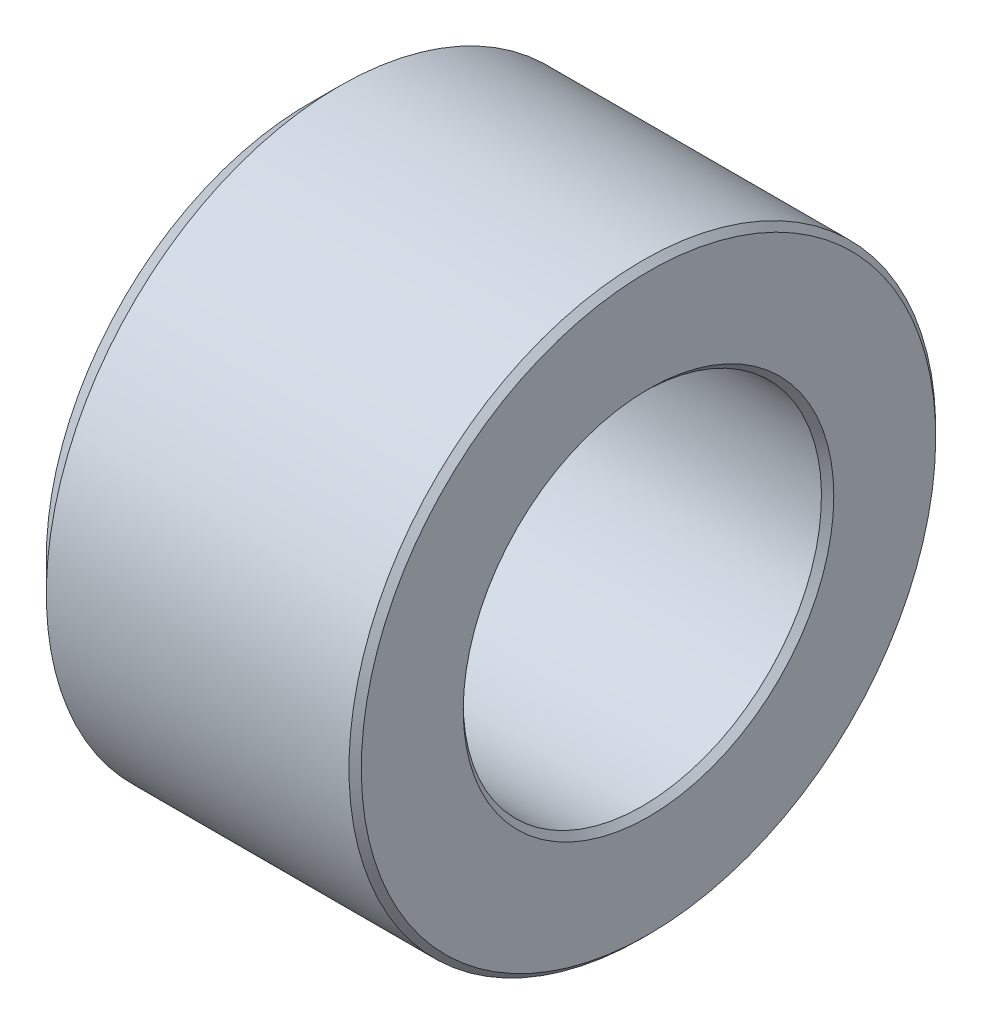
ISO-10303-21;
HEADER;
FILE_DESCRIPTION(('STEP AP214'),'2;1');
FILE_NAME('part.step','',(''),(''),'','','');
FILE_SCHEMA(('AUTOMOTIVE_DESIGN { 1 0 10303 214 1 1 1 1 }'));
ENDSEC;
DATA;
#1=APPLICATION_CONTEXT('core data for automotive mechanical design processes');
#2=APPLICATION_PROTOCOL_DEFINITION('international standard','automotive_design',2000,#1);
#3=PRODUCT_CONTEXT('',#1,'mechanical');
#4=PRODUCT('Part','Part','',(#3));
#5=PRODUCT_RELATED_PRODUCT_CATEGORY('part','',(#4));
#6=PRODUCT_DEFINITION_FORMATION('','',#4);
#7=PRODUCT_DEFINITION_CONTEXT('part definition',#1,'design');
#8=PRODUCT_DEFINITION('design','',#6,#7);
#9=PRODUCT_DEFINITION_SHAPE('','',#8);
#10=(LENGTH_UNIT() NAMED_UNIT(*) SI_UNIT(.MILLI.,.METRE.));
#11=(NAMED_UNIT(*) PLANE_ANGLE_UNIT() SI_UNIT($,.RADIAN.));
#12=(NAMED_UNIT(*) SI_UNIT($,.STERADIAN.) SOLID_ANGLE_UNIT());
#13=UNCERTAINTY_MEASURE_WITH_UNIT(LENGTH_MEASURE(1.E-05),#10,'distance_accuracy_value','');
#14=(GEOMETRIC_REPRESENTATION_CONTEXT(3) GLOBAL_UNCERTAINTY_ASSIGNED_CONTEXT((#13)) GLOBAL_UNIT_ASSIGNED_CONTEXT((#10,
#11,#12)) REPRESENTATION_CONTEXT('',''));
#15=CARTESIAN_POINT('',(0.,0.,0.));
#16=DIRECTION('',(0.,0.,1.));
#17=DIRECTION('',(1.,0.,0.));
#18=AXIS2_PLACEMENT_3D('',#15,#16,#17);
#19=CARTESIAN_POINT('',(2.75,0.,0.));
#20=DIRECTION('',(-1.,0.,0.));
#21=DIRECTION('',(0.,-1.,0.));
#22=AXIS2_PLACEMENT_3D('',#19,#20,#21);
#23=PLANE('',#22);
#24=CARTESIAN_POINT('',(2.75,0.,0.));
#25=DIRECTION('',(-1.,0.,0.));
#26=DIRECTION('',(0.,-1.,0.));
#27=AXIS2_PLACEMENT_3D('',#24,#25,#26);
#28=CIRCLE('',#27,4.65);
#29=CARTESIAN_POINT('',(2.75,-4.65,0.));
#30=VERTEX_POINT('',#29);
#31=EDGE_CURVE('E58',#30,#30,#28,.F.);
#32=ORIENTED_EDGE('',*,*,#31,.T.);
#33=EDGE_LOOP('',(#32));
#34=FACE_BOUND('',#33,.T.);
#35=CARTESIAN_POINT('',(2.75,0.,0.));
#36=DIRECTION('',(-1.,0.,0.));
#37=DIRECTION('',(0.,-1.,0.));
#38=AXIS2_PLACEMENT_3D('',#35,#36,#37);
#39=CIRCLE('',#38,3.);
#40=CARTESIAN_POINT('',(2.75,-3.,0.));
#41=VERTEX_POINT('',#40);
#42=EDGE_CURVE('E61',#41,#41,#39,.T.);
#43=ORIENTED_EDGE('',*,*,#42,.T.);
#44=EDGE_LOOP('',(#43));
#45=FACE_BOUND('',#44,.T.);
#46=ADVANCED_FACE('F32',(#34,#45),#23,.F.);
#47=CARTESIAN_POINT('',(0.,0.,0.));
#48=DIRECTION('',(1.,0.,0.));
#49=DIRECTION('',(0.,1.,0.));
#50=AXIS2_PLACEMENT_3D('',#47,#48,#49);
#51=CYLINDRICAL_SURFACE('',#50,4.75);
#52=CARTESIAN_POINT('',(-2.25,0.,0.));
#53=DIRECTION('',(-1.,0.,0.));
#54=DIRECTION('',(0.,-1.,0.));
#55=AXIS2_PLACEMENT_3D('',#52,#53,#54);
#56=CIRCLE('',#55,4.75);
#57=CARTESIAN_POINT('',(-2.25,-4.75,0.));
#58=VERTEX_POINT('',#57);
#59=EDGE_CURVE('E39',#58,#58,#56,.F.);
#60=ORIENTED_EDGE('',*,*,#59,.T.);
#61=EDGE_LOOP('',(#60));
#62=FACE_BOUND('',#61,.T.);
#63=CARTESIAN_POINT('',(2.65,0.,0.));
#64=DIRECTION('',(-1.,0.,0.));
#65=DIRECTION('',(0.,-1.,0.));
#66=AXIS2_PLACEMENT_3D('',#63,#64,#65);
#67=CIRCLE('',#66,4.75);
#68=CARTESIAN_POINT('',(2.65000000000001,-4.75,0.));
#69=VERTEX_POINT('',#68);
#70=EDGE_CURVE('E55',#69,#69,#67,.T.);
#71=ORIENTED_EDGE('',*,*,#70,.T.);
#72=EDGE_LOOP('',(#71));
#73=FACE_BOUND('',#72,.T.);
#74=ADVANCED_FACE('F86',(#62,#73),#51,.T.);
#75=CARTESIAN_POINT('',(-2.75,0.,0.));
#76=DIRECTION('',(-1.,0.,0.));
#77=DIRECTION('',(0.,-1.,0.));
#78=AXIS2_PLACEMENT_3D('',#75,#76,#77);
#79=PLANE('',#78);
#80=CARTESIAN_POINT('',(-2.75,0.,0.));
#81=DIRECTION('',(-1.,0.,0.));
#82=DIRECTION('',(0.,-1.,0.));
#83=AXIS2_PLACEMENT_3D('',#80,#81,#82);
#84=CIRCLE('',#83,4.25);
#85=CARTESIAN_POINT('',(-2.75,-4.25,0.));
#86=VERTEX_POINT('',#85);
#87=EDGE_CURVE('E10',#86,#86,#84,.T.);
#88=ORIENTED_EDGE('',*,*,#87,.T.);
#89=EDGE_LOOP('',(#88));
#90=FACE_BOUND('',#89,.T.);
#91=CARTESIAN_POINT('',(-2.75,0.,0.));
#92=DIRECTION('',(-1.,0.,0.));
#93=DIRECTION('',(0.,-1.,0.));
#94=AXIS2_PLACEMENT_3D('',#91,#92,#93);
#95=CIRCLE('',#94,3.);
#96=CARTESIAN_POINT('',(-2.75,-3.,0.));
#97=VERTEX_POINT('',#96);
#98=EDGE_CURVE('E43',#97,#97,#95,.F.);
#99=ORIENTED_EDGE('',*,*,#98,.T.);
#100=EDGE_LOOP('',(#99));
#101=FACE_BOUND('',#100,.T.);
#102=ADVANCED_FACE('F77',(#90,#101),#79,.T.);
#103=CARTESIAN_POINT('',(0.,0.,0.));
#104=DIRECTION('',(1.,0.,0.));
#105=DIRECTION('',(0.,1.,0.));
#106=AXIS2_PLACEMENT_3D('',#103,#104,#105);
#107=CYLINDRICAL_SURFACE('',#106,2.9);
#108=CARTESIAN_POINT('',(2.65,0.,0.));
#109=DIRECTION('',(-1.,0.,0.));
#110=DIRECTION('',(0.,-1.,0.));
#111=AXIS2_PLACEMENT_3D('',#108,#109,#110);
#112=CIRCLE('',#111,2.9);
#113=CARTESIAN_POINT('',(2.65,-2.9,0.));
#114=VERTEX_POINT('',#113);
#115=EDGE_CURVE('E47',#114,#114,#112,.F.);
#116=ORIENTED_EDGE('',*,*,#115,.T.);
#117=EDGE_LOOP('',(#116));
#118=FACE_BOUND('',#117,.T.);
#119=CARTESIAN_POINT('',(-2.65,0.,0.));
#120=DIRECTION('',(-1.,0.,0.));
#121=DIRECTION('',(0.,-1.,0.));
#122=AXIS2_PLACEMENT_3D('',#119,#120,#121);
#123=CIRCLE('',#122,2.9);
#124=CARTESIAN_POINT('',(-2.65,-2.9,0.));
#125=VERTEX_POINT('',#124);
#126=EDGE_CURVE('E52',#125,#125,#123,.T.);
#127=ORIENTED_EDGE('',*,*,#126,.T.);
#128=EDGE_LOOP('',(#127));
#129=FACE_BOUND('',#128,.T.);
#130=ADVANCED_FACE('F74',(#118,#129),#107,.F.);
#131=CARTESIAN_POINT('',(2.75,0.,0.));
#132=DIRECTION('',(-1.,0.,0.));
#133=DIRECTION('',(0.,-1.,0.));
#134=AXIS2_PLACEMENT_3D('',#131,#132,#133);
#135=CONICAL_SURFACE('',#134,4.65,0.785398163397453);
#136=ORIENTED_EDGE('',*,*,#70,.F.);
#137=EDGE_LOOP('',(#136));
#138=FACE_BOUND('',#137,.T.);
#139=ORIENTED_EDGE('',*,*,#31,.F.);
#140=EDGE_LOOP('',(#139));
#141=FACE_BOUND('',#140,.T.);
#142=ADVANCED_FACE('F70',(#138,#141),#135,.T.);
#143=CARTESIAN_POINT('',(2.65,0.,0.));
#144=DIRECTION('',(1.,0.,0.));
#145=DIRECTION('',(0.,1.,0.));
#146=AXIS2_PLACEMENT_3D('',#143,#144,#145);
#147=CONICAL_SURFACE('',#146,2.9,0.785398163397444);
#148=ORIENTED_EDGE('',*,*,#42,.F.);
#149=EDGE_LOOP('',(#148));
#150=FACE_BOUND('',#149,.T.);
#151=ORIENTED_EDGE('',*,*,#115,.F.);
#152=EDGE_LOOP('',(#151));
#153=FACE_BOUND('',#152,.T.);
#154=ADVANCED_FACE('F66',(#150,#153),#147,.F.);
#155=CARTESIAN_POINT('',(-2.75,0.,0.));
#156=DIRECTION('',(-1.,0.,0.));
#157=DIRECTION('',(0.,-1.,0.));
#158=AXIS2_PLACEMENT_3D('',#155,#156,#157);
#159=CONICAL_SURFACE('',#158,3.,0.785398163397438);
#160=ORIENTED_EDGE('',*,*,#126,.F.);
#161=EDGE_LOOP('',(#160));
#162=FACE_BOUND('',#161,.T.);
#163=ORIENTED_EDGE('',*,*,#98,.F.);
#164=EDGE_LOOP('',(#163));
#165=FACE_BOUND('',#164,.T.);
#166=ADVANCED_FACE('F69',(#162,#165),#159,.F.);
#167=CARTESIAN_POINT('',(-2.25,0.,0.));
#168=DIRECTION('',(1.,0.,0.));
#169=DIRECTION('',(0.,1.,0.));
#170=AXIS2_PLACEMENT_3D('',#167,#168,#169);
#171=CONICAL_SURFACE('',#170,4.75,0.785398163397451);
#172=ORIENTED_EDGE('',*,*,#87,.F.);
#173=EDGE_LOOP('',(#172));
#174=FACE_BOUND('',#173,.T.);
#175=ORIENTED_EDGE('',*,*,#59,.F.);
#176=EDGE_LOOP('',(#175));
#177=FACE_BOUND('',#176,.T.);
#178=ADVANCED_FACE('F34',(#174,#177),#171,.T.);
#179=CLOSED_SHELL('',(#46,#74,#102,#130,#142,#154,#166,#178));
#180=MANIFOLD_SOLID_BREP('B2',#179);
#181=ADVANCED_BREP_SHAPE_REPRESENTATION('',(#18,#180),#14);
#182=SHAPE_DEFINITION_REPRESENTATION(#9,#181);
ENDSEC;
END-ISO-10303-21;
